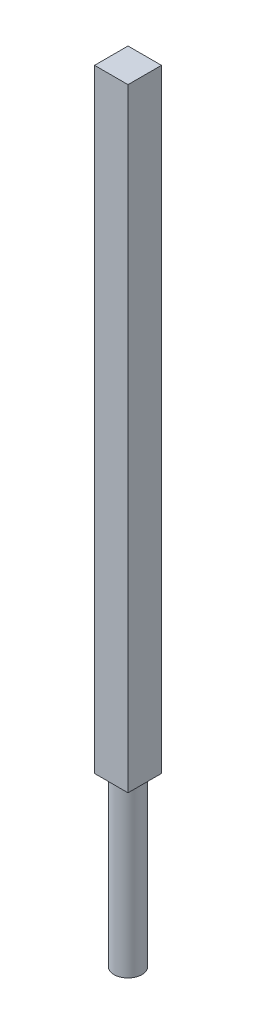
ISO-10303-21;
HEADER;
FILE_DESCRIPTION(('STEP AP214'),'2;1');
FILE_NAME('part.step','',(''),(''),'','','');
FILE_SCHEMA(('AUTOMOTIVE_DESIGN { 1 0 10303 214 1 1 1 1 }'));
ENDSEC;
DATA;
#1=APPLICATION_CONTEXT('core data for automotive mechanical design processes');
#2=APPLICATION_PROTOCOL_DEFINITION('international standard','automotive_design',2000,#1);
#3=PRODUCT_CONTEXT('',#1,'mechanical');
#4=PRODUCT('Part','Part','',(#3));
#5=PRODUCT_RELATED_PRODUCT_CATEGORY('part','',(#4));
#6=PRODUCT_DEFINITION_FORMATION('','',#4);
#7=PRODUCT_DEFINITION_CONTEXT('part definition',#1,'design');
#8=PRODUCT_DEFINITION('design','',#6,#7);
#9=PRODUCT_DEFINITION_SHAPE('','',#8);
#10=(LENGTH_UNIT() NAMED_UNIT(*) SI_UNIT(.MILLI.,.METRE.));
#11=(NAMED_UNIT(*) PLANE_ANGLE_UNIT() SI_UNIT($,.RADIAN.));
#12=(NAMED_UNIT(*) SI_UNIT($,.STERADIAN.) SOLID_ANGLE_UNIT());
#13=UNCERTAINTY_MEASURE_WITH_UNIT(LENGTH_MEASURE(1.E-05),#10,'distance_accuracy_value','');
#14=(GEOMETRIC_REPRESENTATION_CONTEXT(3) GLOBAL_UNCERTAINTY_ASSIGNED_CONTEXT((#13)) GLOBAL_UNIT_ASSIGNED_CONTEXT((#10,
#11,#12)) REPRESENTATION_CONTEXT('',''));
#15=CARTESIAN_POINT('',(0.,0.,0.));
#16=DIRECTION('',(0.,0.,1.));
#17=DIRECTION('',(1.,0.,0.));
#18=AXIS2_PLACEMENT_3D('',#15,#16,#17);
#19=CARTESIAN_POINT('',(0.,150.,0.));
#20=DIRECTION('',(0.,-1.,0.));
#21=DIRECTION('',(0.,0.,-1.));
#22=AXIS2_PLACEMENT_3D('',#19,#20,#21);
#23=CYLINDRICAL_SURFACE('',#22,12.5);
#24=CARTESIAN_POINT('',(0.,150.,0.));
#25=DIRECTION('',(0.,1.,0.));
#26=DIRECTION('',(0.,0.,1.));
#27=AXIS2_PLACEMENT_3D('',#24,#25,#26);
#28=CIRCLE('',#27,12.5);
#29=CARTESIAN_POINT('',(0.,150.,12.5));
#30=VERTEX_POINT('',#29);
#31=EDGE_CURVE('E11',#30,#30,#28,.T.);
#32=ORIENTED_EDGE('',*,*,#31,.F.);
#33=EDGE_LOOP('',(#32));
#34=FACE_BOUND('',#33,.T.);
#35=CARTESIAN_POINT('',(0.,0.,0.));
#36=DIRECTION('',(0.,1.,0.));
#37=DIRECTION('',(0.,0.,1.));
#38=AXIS2_PLACEMENT_3D('',#35,#36,#37);
#39=CIRCLE('',#38,12.5);
#40=CARTESIAN_POINT('',(0.,0.,12.5));
#41=VERTEX_POINT('',#40);
#42=EDGE_CURVE('E38',#41,#41,#39,.T.);
#43=ORIENTED_EDGE('',*,*,#42,.T.);
#44=EDGE_LOOP('',(#43));
#45=FACE_BOUND('',#44,.T.);
#46=ADVANCED_FACE('F35',(#34,#45),#23,.T.);
#47=CARTESIAN_POINT('',(0.,0.,0.));
#48=DIRECTION('',(0.,1.,0.));
#49=DIRECTION('',(0.,0.,1.));
#50=AXIS2_PLACEMENT_3D('',#47,#48,#49);
#51=PLANE('',#50);
#52=ORIENTED_EDGE('',*,*,#42,.F.);
#53=EDGE_LOOP('',(#52));
#54=FACE_BOUND('',#53,.T.);
#55=ADVANCED_FACE('F114',(#54),#51,.F.);
#56=CARTESIAN_POINT('',(0.,150.,0.));
#57=DIRECTION('',(0.,-1.,0.));
#58=DIRECTION('',(0.,0.,-1.));
#59=AXIS2_PLACEMENT_3D('',#56,#57,#58);
#60=PLANE('',#59);
#61=DIRECTION('',(0.,0.,-1.));
#62=VECTOR('',#61,1.);
#63=CARTESIAN_POINT('',(15.,150.,15.));
#64=LINE('',#63,#62);
#65=CARTESIAN_POINT('',(15.,150.,15.));
#66=VERTEX_POINT('',#65);
#67=CARTESIAN_POINT('',(15.,150.,-15.));
#68=VERTEX_POINT('',#67);
#69=EDGE_CURVE('E102',#66,#68,#64,.T.);
#70=ORIENTED_EDGE('',*,*,#69,.F.);
#71=DIRECTION('',(1.,0.,0.));
#72=VECTOR('',#71,1.);
#73=CARTESIAN_POINT('',(-15.,150.,15.));
#74=LINE('',#73,#72);
#75=CARTESIAN_POINT('',(-15.,150.,15.));
#76=VERTEX_POINT('',#75);
#77=EDGE_CURVE('E74',#76,#66,#74,.T.);
#78=ORIENTED_EDGE('',*,*,#77,.F.);
#79=DIRECTION('',(0.,0.,1.));
#80=VECTOR('',#79,1.);
#81=CARTESIAN_POINT('',(-15.,150.,15.));
#82=LINE('',#81,#80);
#83=CARTESIAN_POINT('',(-15.,150.,-15.));
#84=VERTEX_POINT('',#83);
#85=EDGE_CURVE('E68',#84,#76,#82,.T.);
#86=ORIENTED_EDGE('',*,*,#85,.F.);
#87=DIRECTION('',(-1.,0.,0.));
#88=VECTOR('',#87,1.);
#89=CARTESIAN_POINT('',(-15.,150.,-15.));
#90=LINE('',#89,#88);
#91=EDGE_CURVE('E92',#68,#84,#90,.T.);
#92=ORIENTED_EDGE('',*,*,#91,.F.);
#93=EDGE_LOOP('',(#70,#78,#86,#92));
#94=FACE_BOUND('',#93,.T.);
#95=ORIENTED_EDGE('',*,*,#31,.T.);
#96=EDGE_LOOP('',(#95));
#97=FACE_BOUND('',#96,.T.);
#98=ADVANCED_FACE('F116',(#94,#97),#60,.T.);
#99=CARTESIAN_POINT('',(15.,700.,15.));
#100=DIRECTION('',(-1.,0.,0.));
#101=DIRECTION('',(0.,0.,1.));
#102=AXIS2_PLACEMENT_3D('',#99,#100,#101);
#103=PLANE('',#102);
#104=ORIENTED_EDGE('',*,*,#69,.T.);
#105=DIRECTION('',(0.,-1.,0.));
#106=VECTOR('',#105,1.);
#107=CARTESIAN_POINT('',(15.,700.,-15.));
#108=LINE('',#107,#106);
#109=CARTESIAN_POINT('',(15.,700.,-15.));
#110=VERTEX_POINT('',#109);
#111=EDGE_CURVE('E93',#110,#68,#108,.T.);
#112=ORIENTED_EDGE('',*,*,#111,.F.);
#113=DIRECTION('',(0.,0.,-1.));
#114=VECTOR('',#113,1.);
#115=CARTESIAN_POINT('',(15.,700.,15.));
#116=LINE('',#115,#114);
#117=CARTESIAN_POINT('',(15.,700.,15.));
#118=VERTEX_POINT('',#117);
#119=EDGE_CURVE('E87',#118,#110,#116,.T.);
#120=ORIENTED_EDGE('',*,*,#119,.F.);
#121=DIRECTION('',(0.,-1.,0.));
#122=VECTOR('',#121,1.);
#123=CARTESIAN_POINT('',(15.,700.,15.));
#124=LINE('',#123,#122);
#125=EDGE_CURVE('E98',#118,#66,#124,.T.);
#126=ORIENTED_EDGE('',*,*,#125,.T.);
#127=EDGE_LOOP('',(#104,#112,#120,#126));
#128=FACE_BOUND('',#127,.T.);
#129=ADVANCED_FACE('F121',(#128),#103,.F.);
#130=CARTESIAN_POINT('',(-15.,700.,-15.));
#131=DIRECTION('',(0.,0.,1.));
#132=DIRECTION('',(1.,0.,0.));
#133=AXIS2_PLACEMENT_3D('',#130,#131,#132);
#134=PLANE('',#133);
#135=ORIENTED_EDGE('',*,*,#91,.T.);
#136=DIRECTION('',(0.,-1.,0.));
#137=VECTOR('',#136,1.);
#138=CARTESIAN_POINT('',(-15.,700.,-15.));
#139=LINE('',#138,#137);
#140=CARTESIAN_POINT('',(-15.,700.,-15.));
#141=VERTEX_POINT('',#140);
#142=EDGE_CURVE('E90',#141,#84,#139,.T.);
#143=ORIENTED_EDGE('',*,*,#142,.F.);
#144=DIRECTION('',(-1.,0.,0.));
#145=VECTOR('',#144,1.);
#146=CARTESIAN_POINT('',(-15.,700.,-15.));
#147=LINE('',#146,#145);
#148=EDGE_CURVE('E82',#110,#141,#147,.T.);
#149=ORIENTED_EDGE('',*,*,#148,.F.);
#150=ORIENTED_EDGE('',*,*,#111,.T.);
#151=EDGE_LOOP('',(#135,#143,#149,#150));
#152=FACE_BOUND('',#151,.T.);
#153=ADVANCED_FACE('F91',(#152),#134,.F.);
#154=CARTESIAN_POINT('',(-15.,700.,15.));
#155=DIRECTION('',(1.,0.,0.));
#156=DIRECTION('',(0.,0.,-1.));
#157=AXIS2_PLACEMENT_3D('',#154,#155,#156);
#158=PLANE('',#157);
#159=ORIENTED_EDGE('',*,*,#85,.T.);
#160=DIRECTION('',(0.,-1.,0.));
#161=VECTOR('',#160,1.);
#162=CARTESIAN_POINT('',(-15.,700.,15.));
#163=LINE('',#162,#161);
#164=CARTESIAN_POINT('',(-15.,700.,15.));
#165=VERTEX_POINT('',#164);
#166=EDGE_CURVE('E94',#165,#76,#163,.T.);
#167=ORIENTED_EDGE('',*,*,#166,.F.);
#168=DIRECTION('',(0.,0.,1.));
#169=VECTOR('',#168,1.);
#170=CARTESIAN_POINT('',(-15.,700.,15.));
#171=LINE('',#170,#169);
#172=EDGE_CURVE('E85',#141,#165,#171,.T.);
#173=ORIENTED_EDGE('',*,*,#172,.F.);
#174=ORIENTED_EDGE('',*,*,#142,.T.);
#175=EDGE_LOOP('',(#159,#167,#173,#174));
#176=FACE_BOUND('',#175,.T.);
#177=ADVANCED_FACE('F96',(#176),#158,.F.);
#178=CARTESIAN_POINT('',(-15.,700.,15.));
#179=DIRECTION('',(0.,0.,-1.));
#180=DIRECTION('',(-1.,0.,0.));
#181=AXIS2_PLACEMENT_3D('',#178,#179,#180);
#182=PLANE('',#181);
#183=ORIENTED_EDGE('',*,*,#77,.T.);
#184=ORIENTED_EDGE('',*,*,#125,.F.);
#185=DIRECTION('',(1.,0.,0.));
#186=VECTOR('',#185,1.);
#187=CARTESIAN_POINT('',(-15.,700.,15.));
#188=LINE('',#187,#186);
#189=EDGE_CURVE('E51',#165,#118,#188,.T.);
#190=ORIENTED_EDGE('',*,*,#189,.F.);
#191=ORIENTED_EDGE('',*,*,#166,.T.);
#192=EDGE_LOOP('',(#183,#184,#190,#191));
#193=FACE_BOUND('',#192,.T.);
#194=ADVANCED_FACE('F133',(#193),#182,.F.);
#195=CARTESIAN_POINT('',(0.,700.,0.));
#196=DIRECTION('',(0.,-1.,0.));
#197=DIRECTION('',(0.,0.,-1.));
#198=AXIS2_PLACEMENT_3D('',#195,#196,#197);
#199=PLANE('',#198);
#200=ORIENTED_EDGE('',*,*,#119,.T.);
#201=ORIENTED_EDGE('',*,*,#148,.T.);
#202=ORIENTED_EDGE('',*,*,#172,.T.);
#203=ORIENTED_EDGE('',*,*,#189,.T.);
#204=EDGE_LOOP('',(#200,#201,#202,#203));
#205=FACE_BOUND('',#204,.T.);
#206=ADVANCED_FACE('F83',(#205),#199,.F.);
#207=CLOSED_SHELL('',(#46,#55,#98,#129,#153,#177,#194,#206));
#208=MANIFOLD_SOLID_BREP('B2',#207);
#209=ADVANCED_BREP_SHAPE_REPRESENTATION('',(#18,#208),#14);
#210=SHAPE_DEFINITION_REPRESENTATION(#9,#209);
ENDSEC;
END-ISO-10303-21;
